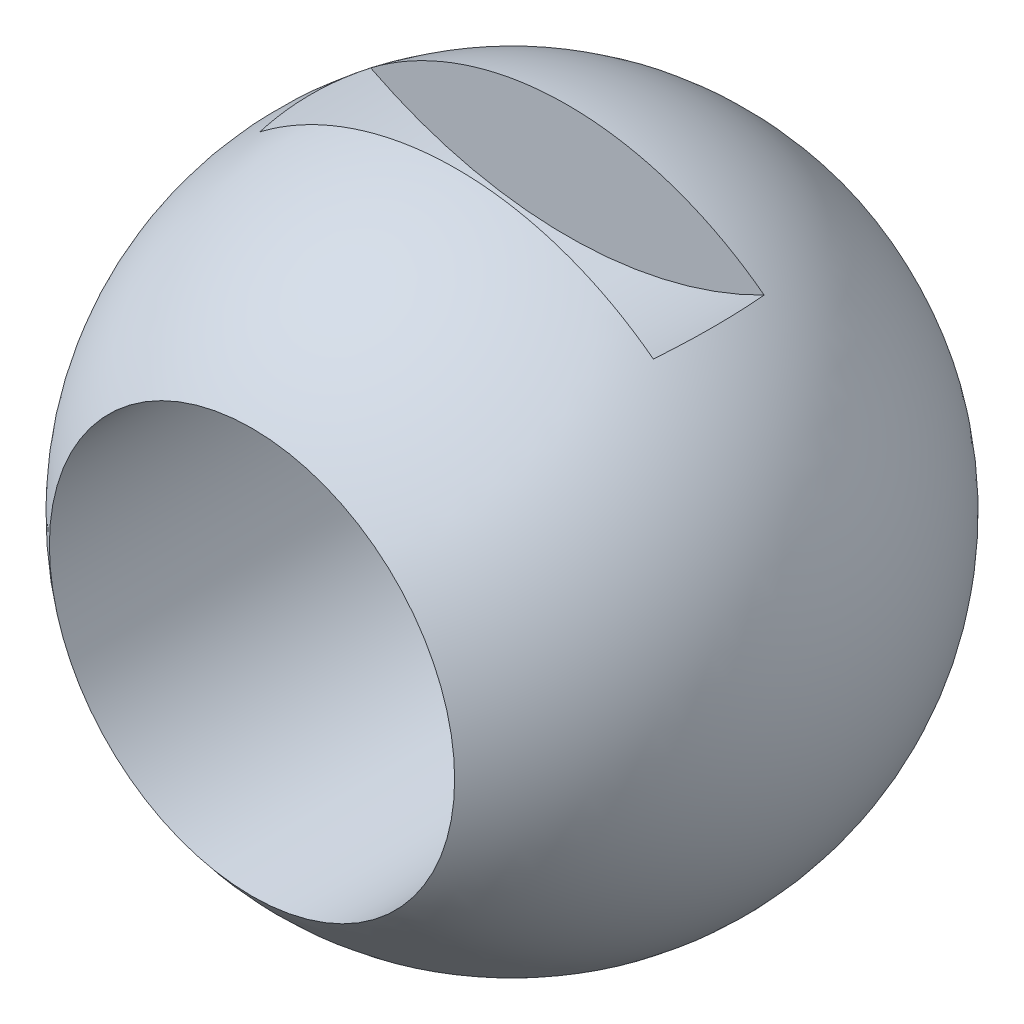
ISO-10303-21;
HEADER;
FILE_DESCRIPTION(('STEP AP214'),'2;1');
FILE_NAME('part.step','',(''),(''),'','','');
FILE_SCHEMA(('AUTOMOTIVE_DESIGN { 1 0 10303 214 1 1 1 1 }'));
ENDSEC;
DATA;
#1=APPLICATION_CONTEXT('core data for automotive mechanical design processes');
#2=APPLICATION_PROTOCOL_DEFINITION('international standard','automotive_design',2000,#1);
#3=PRODUCT_CONTEXT('',#1,'mechanical');
#4=PRODUCT('Part','Part','',(#3));
#5=PRODUCT_RELATED_PRODUCT_CATEGORY('part','',(#4));
#6=PRODUCT_DEFINITION_FORMATION('','',#4);
#7=PRODUCT_DEFINITION_CONTEXT('part definition',#1,'design');
#8=PRODUCT_DEFINITION('design','',#6,#7);
#9=PRODUCT_DEFINITION_SHAPE('','',#8);
#10=(LENGTH_UNIT() NAMED_UNIT(*) SI_UNIT(.MILLI.,.METRE.));
#11=(NAMED_UNIT(*) PLANE_ANGLE_UNIT() SI_UNIT($,.RADIAN.));
#12=(NAMED_UNIT(*) SI_UNIT($,.STERADIAN.) SOLID_ANGLE_UNIT());
#13=UNCERTAINTY_MEASURE_WITH_UNIT(LENGTH_MEASURE(1.E-05),#10,'distance_accuracy_value','');
#14=(GEOMETRIC_REPRESENTATION_CONTEXT(3) GLOBAL_UNCERTAINTY_ASSIGNED_CONTEXT((#13)) GLOBAL_UNIT_ASSIGNED_CONTEXT((#10,
#11,#12)) REPRESENTATION_CONTEXT('',''));
#15=CARTESIAN_POINT('',(0.,0.,0.));
#16=DIRECTION('',(0.,0.,1.));
#17=DIRECTION('',(1.,0.,0.));
#18=AXIS2_PLACEMENT_3D('',#15,#16,#17);
#19=CARTESIAN_POINT('',(0.,0.,0.));
#20=DIRECTION('',(0.,1.,0.));
#21=DIRECTION('',(1.,0.,0.));
#22=AXIS2_PLACEMENT_3D('',#19,#20,#21);
#23=SPHERICAL_SURFACE('',#22,15.494);
#24=CARTESIAN_POINT('',(0.,0.,12.2204096085197));
#25=DIRECTION('',(0.,0.,-1.));
#26=DIRECTION('',(-1.,0.,0.));
#27=AXIS2_PLACEMENT_3D('',#24,#25,#26);
#28=CIRCLE('',#27,9.525);
#29=CARTESIAN_POINT('',(-9.525,0.,12.2204096085197));
#30=VERTEX_POINT('',#29);
#31=EDGE_CURVE('E47',#30,#30,#28,.F.);
#32=ORIENTED_EDGE('',*,*,#31,.F.);
#33=EDGE_LOOP('',(#32));
#34=FACE_BOUND('',#33,.T.);
#35=CARTESIAN_POINT('',(0.,0.,-12.2204096085197));
#36=DIRECTION('',(0.,0.,1.));
#37=DIRECTION('',(1.,0.,0.));
#38=AXIS2_PLACEMENT_3D('',#35,#36,#37);
#39=CIRCLE('',#38,9.525);
#40=CARTESIAN_POINT('',(9.525,0.,-12.2204096085197));
#41=VERTEX_POINT('',#40);
#42=EDGE_CURVE('E91',#41,#41,#39,.F.);
#43=ORIENTED_EDGE('',*,*,#42,.F.);
#44=EDGE_LOOP('',(#43));
#45=FACE_BOUND('',#44,.T.);
#46=CARTESIAN_POINT('',(-9.24731779868117,12.1561464222917,-2.60369999999987));
#47=CARTESIAN_POINT('',(-9.28358755724573,12.1746899394319,-2.38831073949721));
#48=CARTESIAN_POINT('',(-9.31525443009283,12.191003765038,-2.1719875429917));
#49=CARTESIAN_POINT('',(-9.36944165626053,12.2190551355474,-1.73791023557852));
#50=CARTESIAN_POINT('',(-9.39196230272016,12.2307928271166,-1.52015617075789));
#51=CARTESIAN_POINT('',(-9.44557804655422,12.258801415917,-0.86925216968629));
#52=CARTESIAN_POINT('',(-9.46336646019797,12.2682,-0.434626084843145));
#53=CARTESIAN_POINT('',(-9.46336646019797,12.2682,0.434626084843145));
#54=CARTESIAN_POINT('',(-9.44557804655422,12.258801415917,0.86925216968629));
#55=CARTESIAN_POINT('',(-9.39196230272016,12.2307928271166,1.52015617075789));
#56=CARTESIAN_POINT('',(-9.36944165626053,12.2190551355474,1.73791023557852));
#57=CARTESIAN_POINT('',(-9.31525443009283,12.191003765038,2.17198754299171));
#58=CARTESIAN_POINT('',(-9.28358755724573,12.1746899394319,2.38831073949721));
#59=CARTESIAN_POINT('',(-9.24731779868117,12.1561464222917,2.60369999999987));
#60=B_SPLINE_CURVE_WITH_KNOTS('',3,(#46,#47,#48,#49,#50,#51,#52,#53,#54,#55,#56,#57,#58,#59),
.UNSPECIFIED.,.F.,.F.,(4,2,2,2,2,2,4),(0.,0.657497467069434,1.31497385950416,2.61826895870475,
3.92156405790534,4.57904045034006,5.2365379174095),.UNSPECIFIED.);
#61=CARTESIAN_POINT('',(-9.24735148035741,12.1561636361449,-2.6035));
#62=VERTEX_POINT('',#61);
#63=CARTESIAN_POINT('',(-9.24735148035741,12.1561636361449,2.6035));
#64=VERTEX_POINT('',#63);
#65=EDGE_CURVE('E72',#62,#64,#60,.T.);
#66=ORIENTED_EDGE('',*,*,#65,.F.);
#67=CARTESIAN_POINT('',(0.,0.,-2.6035));
#68=DIRECTION('',(0.,0.,1.));
#69=DIRECTION('',(1.,0.,0.));
#70=AXIS2_PLACEMENT_3D('',#67,#68,#69);
#71=CIRCLE('',#70,15.273697121195);
#72=CARTESIAN_POINT('',(9.24735148035741,12.1561636361449,-2.6035));
#73=VERTEX_POINT('',#72);
#74=EDGE_CURVE('E11',#62,#73,#71,.F.);
#75=ORIENTED_EDGE('',*,*,#74,.T.);
#76=CARTESIAN_POINT('',(9.24731779868117,12.1561464222917,2.60369999999987));
#77=CARTESIAN_POINT('',(9.28358755724573,12.1746899394319,2.38831073949721));
#78=CARTESIAN_POINT('',(9.31525443009283,12.191003765038,2.1719875429917));
#79=CARTESIAN_POINT('',(9.36944165626053,12.2190551355474,1.73791023557852));
#80=CARTESIAN_POINT('',(9.39196230272016,12.2307928271166,1.52015617075789));
#81=CARTESIAN_POINT('',(9.44557804655422,12.258801415917,0.86925216968629));
#82=CARTESIAN_POINT('',(9.46336646019797,12.2682,0.434626084843145));
#83=CARTESIAN_POINT('',(9.46336646019797,12.2682,-0.434626084843145));
#84=CARTESIAN_POINT('',(9.44557804655422,12.258801415917,-0.86925216968629));
#85=CARTESIAN_POINT('',(9.39196230272016,12.2307928271166,-1.52015617075789));
#86=CARTESIAN_POINT('',(9.36944165626053,12.2190551355474,-1.73791023557852));
#87=CARTESIAN_POINT('',(9.31525443009283,12.191003765038,-2.17198754299171));
#88=CARTESIAN_POINT('',(9.28358755724573,12.1746899394319,-2.38831073949721));
#89=CARTESIAN_POINT('',(9.24731779868117,12.1561464222917,-2.60369999999987));
#90=B_SPLINE_CURVE_WITH_KNOTS('',3,(#76,#77,#78,#79,#80,#81,#82,#83,#84,#85,#86,#87,#88,#89),
.UNSPECIFIED.,.F.,.F.,(4,2,2,2,2,2,4),(0.,0.657497467069434,1.31497385950416,2.61826895870475,
3.92156405790534,4.57904045034006,5.2365379174095),.UNSPECIFIED.);
#91=CARTESIAN_POINT('',(9.24735148035741,12.1561636361449,2.6035));
#92=VERTEX_POINT('',#91);
#93=EDGE_CURVE('E61',#92,#73,#90,.T.);
#94=ORIENTED_EDGE('',*,*,#93,.F.);
#95=CARTESIAN_POINT('',(0.,0.,2.6035));
#96=DIRECTION('',(0.,0.,1.));
#97=DIRECTION('',(1.,0.,0.));
#98=AXIS2_PLACEMENT_3D('',#95,#96,#97);
#99=CIRCLE('',#98,15.273697121195);
#100=EDGE_CURVE('E53',#64,#92,#99,.F.);
#101=ORIENTED_EDGE('',*,*,#100,.F.);
#102=EDGE_LOOP('',(#66,#75,#94,#101));
#103=FACE_BOUND('',#102,.T.);
#104=ADVANCED_FACE('F43',(#34,#45,#103),#23,.T.);
#105=CARTESIAN_POINT('',(0.,0.,-2.6035));
#106=DIRECTION('',(0.,0.,1.));
#107=DIRECTION('',(1.,0.,0.));
#108=AXIS2_PLACEMENT_3D('',#105,#106,#107);
#109=PLANE('',#108);
#110=ORIENTED_EDGE('',*,*,#74,.F.);
#111=CARTESIAN_POINT('',(0.,30.2500546106902,-2.6035));
#112=DIRECTION('',(0.,0.,1.));
#113=DIRECTION('',(1.,0.,0.));
#114=AXIS2_PLACEMENT_3D('',#111,#112,#113);
#115=CIRCLE('',#114,20.32);
#116=EDGE_CURVE('E77',#62,#73,#115,.T.);
#117=ORIENTED_EDGE('',*,*,#116,.T.);
#118=EDGE_LOOP('',(#110,#117));
#119=FACE_BOUND('',#118,.T.);
#120=ADVANCED_FACE('F107',(#119),#109,.T.);
#121=CARTESIAN_POINT('',(0.,0.,2.6035));
#122=DIRECTION('',(0.,0.,1.));
#123=DIRECTION('',(1.,0.,0.));
#124=AXIS2_PLACEMENT_3D('',#121,#122,#123);
#125=PLANE('',#124);
#126=ORIENTED_EDGE('',*,*,#100,.T.);
#127=CARTESIAN_POINT('',(0.,30.2500546106902,2.6035));
#128=DIRECTION('',(0.,0.,1.));
#129=DIRECTION('',(1.,0.,0.));
#130=AXIS2_PLACEMENT_3D('',#127,#128,#129);
#131=CIRCLE('',#130,20.32);
#132=EDGE_CURVE('E76',#64,#92,#131,.T.);
#133=ORIENTED_EDGE('',*,*,#132,.F.);
#134=EDGE_LOOP('',(#126,#133));
#135=FACE_BOUND('',#134,.T.);
#136=ADVANCED_FACE('F84',(#135),#125,.F.);
#137=CARTESIAN_POINT('',(0.,30.2500546106902,-2.6035));
#138=DIRECTION('',(0.,0.,1.));
#139=DIRECTION('',(1.,0.,0.));
#140=AXIS2_PLACEMENT_3D('',#137,#138,#139);
#141=CYLINDRICAL_SURFACE('',#140,20.32);
#142=ORIENTED_EDGE('',*,*,#93,.T.);
#143=ORIENTED_EDGE('',*,*,#116,.F.);
#144=ORIENTED_EDGE('',*,*,#65,.T.);
#145=ORIENTED_EDGE('',*,*,#132,.T.);
#146=EDGE_LOOP('',(#142,#143,#144,#145));
#147=FACE_BOUND('',#146,.T.);
#148=ADVANCED_FACE('F74',(#147),#141,.F.);
#149=CARTESIAN_POINT('',(0.,0.,-15.494));
#150=DIRECTION('',(0.,0.,1.));
#151=DIRECTION('',(1.,0.,0.));
#152=AXIS2_PLACEMENT_3D('',#149,#150,#151);
#153=CYLINDRICAL_SURFACE('',#152,9.525);
#154=ORIENTED_EDGE('',*,*,#31,.T.);
#155=EDGE_LOOP('',(#154));
#156=FACE_BOUND('',#155,.T.);
#157=ORIENTED_EDGE('',*,*,#42,.T.);
#158=EDGE_LOOP('',(#157));
#159=FACE_BOUND('',#158,.T.);
#160=ADVANCED_FACE('F106',(#156,#159),#153,.F.);
#161=CLOSED_SHELL('',(#104,#120,#136,#148,#160));
#162=MANIFOLD_SOLID_BREP('B2',#161);
#163=ADVANCED_BREP_SHAPE_REPRESENTATION('',(#18,#162),#14);
#164=SHAPE_DEFINITION_REPRESENTATION(#9,#163);
ENDSEC;
END-ISO-10303-21;
